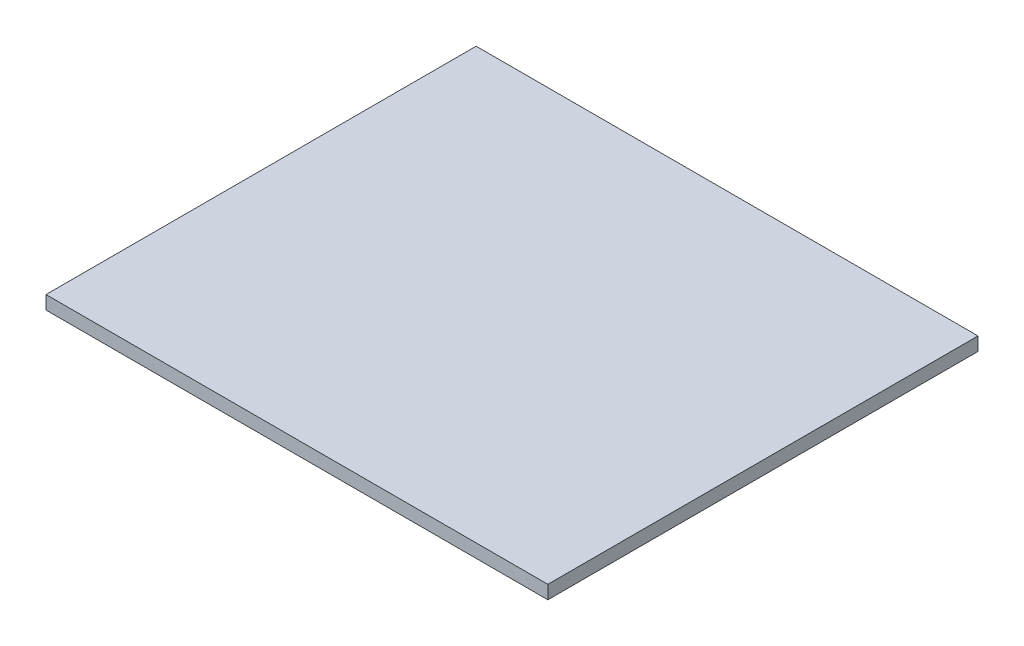
ISO-10303-21;
HEADER;
FILE_DESCRIPTION(('STEP AP214'),'2;1');
FILE_NAME('part.step','',(''),(''),'','','');
FILE_SCHEMA(('AUTOMOTIVE_DESIGN { 1 0 10303 214 1 1 1 1 }'));
ENDSEC;
DATA;
#1=APPLICATION_CONTEXT('core data for automotive mechanical design processes');
#2=APPLICATION_PROTOCOL_DEFINITION('international standard','automotive_design',2000,#1);
#3=PRODUCT_CONTEXT('',#1,'mechanical');
#4=PRODUCT('Part','Part','',(#3));
#5=PRODUCT_RELATED_PRODUCT_CATEGORY('part','',(#4));
#6=PRODUCT_DEFINITION_FORMATION('','',#4);
#7=PRODUCT_DEFINITION_CONTEXT('part definition',#1,'design');
#8=PRODUCT_DEFINITION('design','',#6,#7);
#9=PRODUCT_DEFINITION_SHAPE('','',#8);
#10=(LENGTH_UNIT() NAMED_UNIT(*) SI_UNIT(.MILLI.,.METRE.));
#11=(NAMED_UNIT(*) PLANE_ANGLE_UNIT() SI_UNIT($,.RADIAN.));
#12=(NAMED_UNIT(*) SI_UNIT($,.STERADIAN.) SOLID_ANGLE_UNIT());
#13=UNCERTAINTY_MEASURE_WITH_UNIT(LENGTH_MEASURE(1.E-05),#10,'distance_accuracy_value','');
#14=(GEOMETRIC_REPRESENTATION_CONTEXT(3) GLOBAL_UNCERTAINTY_ASSIGNED_CONTEXT((#13)) GLOBAL_UNIT_ASSIGNED_CONTEXT((#10,
#11,#12)) REPRESENTATION_CONTEXT('',''));
#15=CARTESIAN_POINT('',(0.,0.,0.));
#16=DIRECTION('',(0.,0.,1.));
#17=DIRECTION('',(1.,0.,0.));
#18=AXIS2_PLACEMENT_3D('',#15,#16,#17);
#19=CARTESIAN_POINT('',(355.6,19.05,304.8));
#20=DIRECTION('',(-1.,0.,0.));
#21=DIRECTION('',(0.,0.,1.));
#22=AXIS2_PLACEMENT_3D('',#19,#20,#21);
#23=PLANE('',#22);
#24=DIRECTION('',(0.,0.,-1.));
#25=VECTOR('',#24,1.);
#26=CARTESIAN_POINT('',(355.6,0.,304.8));
#27=LINE('',#26,#25);
#28=CARTESIAN_POINT('',(355.6,0.,304.8));
#29=VERTEX_POINT('',#28);
#30=CARTESIAN_POINT('',(355.6,0.,-304.8));
#31=VERTEX_POINT('',#30);
#32=EDGE_CURVE('E97',#29,#31,#27,.T.);
#33=ORIENTED_EDGE('',*,*,#32,.T.);
#34=DIRECTION('',(0.,-1.,0.));
#35=VECTOR('',#34,1.);
#36=CARTESIAN_POINT('',(355.6,19.05,-304.8));
#37=LINE('',#36,#35);
#38=CARTESIAN_POINT('',(355.6,19.05,-304.8));
#39=VERTEX_POINT('',#38);
#40=EDGE_CURVE('E11',#39,#31,#37,.T.);
#41=ORIENTED_EDGE('',*,*,#40,.F.);
#42=DIRECTION('',(0.,0.,-1.));
#43=VECTOR('',#42,1.);
#44=CARTESIAN_POINT('',(355.6,19.05,304.8));
#45=LINE('',#44,#43);
#46=CARTESIAN_POINT('',(355.6,19.05,304.8));
#47=VERTEX_POINT('',#46);
#48=EDGE_CURVE('E85',#47,#39,#45,.T.);
#49=ORIENTED_EDGE('',*,*,#48,.F.);
#50=DIRECTION('',(0.,-1.,0.));
#51=VECTOR('',#50,1.);
#52=CARTESIAN_POINT('',(355.6,19.05,304.8));
#53=LINE('',#52,#51);
#54=EDGE_CURVE('E93',#47,#29,#53,.T.);
#55=ORIENTED_EDGE('',*,*,#54,.T.);
#56=EDGE_LOOP('',(#33,#41,#49,#55));
#57=FACE_BOUND('',#56,.T.);
#58=ADVANCED_FACE('F34',(#57),#23,.F.);
#59=CARTESIAN_POINT('',(-355.6,19.05,-304.8));
#60=DIRECTION('',(0.,0.,1.));
#61=DIRECTION('',(1.,0.,0.));
#62=AXIS2_PLACEMENT_3D('',#59,#60,#61);
#63=PLANE('',#62);
#64=DIRECTION('',(-1.,0.,0.));
#65=VECTOR('',#64,1.);
#66=CARTESIAN_POINT('',(-355.6,0.,-304.8));
#67=LINE('',#66,#65);
#68=CARTESIAN_POINT('',(-355.6,0.,-304.8));
#69=VERTEX_POINT('',#68);
#70=EDGE_CURVE('E89',#31,#69,#67,.T.);
#71=ORIENTED_EDGE('',*,*,#70,.T.);
#72=DIRECTION('',(0.,-1.,0.));
#73=VECTOR('',#72,1.);
#74=CARTESIAN_POINT('',(-355.6,19.05,-304.8));
#75=LINE('',#74,#73);
#76=CARTESIAN_POINT('',(-355.6,19.05,-304.8));
#77=VERTEX_POINT('',#76);
#78=EDGE_CURVE('E42',#77,#69,#75,.T.);
#79=ORIENTED_EDGE('',*,*,#78,.F.);
#80=DIRECTION('',(-1.,0.,0.));
#81=VECTOR('',#80,1.);
#82=CARTESIAN_POINT('',(-355.6,19.05,-304.8));
#83=LINE('',#82,#81);
#84=EDGE_CURVE('E80',#39,#77,#83,.T.);
#85=ORIENTED_EDGE('',*,*,#84,.F.);
#86=ORIENTED_EDGE('',*,*,#40,.T.);
#87=EDGE_LOOP('',(#71,#79,#85,#86));
#88=FACE_BOUND('',#87,.T.);
#89=ADVANCED_FACE('F88',(#88),#63,.F.);
#90=CARTESIAN_POINT('',(-355.6,19.05,304.8));
#91=DIRECTION('',(1.,0.,0.));
#92=DIRECTION('',(0.,0.,-1.));
#93=AXIS2_PLACEMENT_3D('',#90,#91,#92);
#94=PLANE('',#93);
#95=DIRECTION('',(0.,0.,1.));
#96=VECTOR('',#95,1.);
#97=CARTESIAN_POINT('',(-355.6,0.,304.8));
#98=LINE('',#97,#96);
#99=CARTESIAN_POINT('',(-355.6,0.,304.8));
#100=VERTEX_POINT('',#99);
#101=EDGE_CURVE('E67',#69,#100,#98,.T.);
#102=ORIENTED_EDGE('',*,*,#101,.T.);
#103=DIRECTION('',(0.,-1.,0.));
#104=VECTOR('',#103,1.);
#105=CARTESIAN_POINT('',(-355.6,19.05,304.8));
#106=LINE('',#105,#104);
#107=CARTESIAN_POINT('',(-355.6,19.05,304.8));
#108=VERTEX_POINT('',#107);
#109=EDGE_CURVE('E90',#108,#100,#106,.T.);
#110=ORIENTED_EDGE('',*,*,#109,.F.);
#111=DIRECTION('',(0.,0.,1.));
#112=VECTOR('',#111,1.);
#113=CARTESIAN_POINT('',(-355.6,19.05,304.8));
#114=LINE('',#113,#112);
#115=EDGE_CURVE('E83',#77,#108,#114,.T.);
#116=ORIENTED_EDGE('',*,*,#115,.F.);
#117=ORIENTED_EDGE('',*,*,#78,.T.);
#118=EDGE_LOOP('',(#102,#110,#116,#117));
#119=FACE_BOUND('',#118,.T.);
#120=ADVANCED_FACE('F91',(#119),#94,.F.);
#121=CARTESIAN_POINT('',(-355.6,19.05,304.8));
#122=DIRECTION('',(0.,0.,-1.));
#123=DIRECTION('',(-1.,0.,0.));
#124=AXIS2_PLACEMENT_3D('',#121,#122,#123);
#125=PLANE('',#124);
#126=DIRECTION('',(1.,0.,0.));
#127=VECTOR('',#126,1.);
#128=CARTESIAN_POINT('',(-355.6,0.,304.8));
#129=LINE('',#128,#127);
#130=EDGE_CURVE('E73',#100,#29,#129,.T.);
#131=ORIENTED_EDGE('',*,*,#130,.T.);
#132=ORIENTED_EDGE('',*,*,#54,.F.);
#133=DIRECTION('',(1.,0.,0.));
#134=VECTOR('',#133,1.);
#135=CARTESIAN_POINT('',(-355.6,19.05,304.8));
#136=LINE('',#135,#134);
#137=EDGE_CURVE('E50',#108,#47,#136,.T.);
#138=ORIENTED_EDGE('',*,*,#137,.F.);
#139=ORIENTED_EDGE('',*,*,#109,.T.);
#140=EDGE_LOOP('',(#131,#132,#138,#139));
#141=FACE_BOUND('',#140,.T.);
#142=ADVANCED_FACE('F104',(#141),#125,.F.);
#143=CARTESIAN_POINT('',(0.,19.05,0.));
#144=DIRECTION('',(0.,-1.,0.));
#145=DIRECTION('',(0.,0.,-1.));
#146=AXIS2_PLACEMENT_3D('',#143,#144,#145);
#147=PLANE('',#146);
#148=ORIENTED_EDGE('',*,*,#48,.T.);
#149=ORIENTED_EDGE('',*,*,#84,.T.);
#150=ORIENTED_EDGE('',*,*,#115,.T.);
#151=ORIENTED_EDGE('',*,*,#137,.T.);
#152=EDGE_LOOP('',(#148,#149,#150,#151));
#153=FACE_BOUND('',#152,.T.);
#154=ADVANCED_FACE('F81',(#153),#147,.F.);
#155=CARTESIAN_POINT('',(0.,0.,0.));
#156=DIRECTION('',(0.,-1.,0.));
#157=DIRECTION('',(0.,0.,-1.));
#158=AXIS2_PLACEMENT_3D('',#155,#156,#157);
#159=PLANE('',#158);
#160=ORIENTED_EDGE('',*,*,#32,.F.);
#161=ORIENTED_EDGE('',*,*,#130,.F.);
#162=ORIENTED_EDGE('',*,*,#101,.F.);
#163=ORIENTED_EDGE('',*,*,#70,.F.);
#164=EDGE_LOOP('',(#160,#161,#162,#163));
#165=FACE_BOUND('',#164,.T.);
#166=ADVANCED_FACE('F107',(#165),#159,.T.);
#167=CLOSED_SHELL('',(#58,#89,#120,#142,#154,#166));
#168=MANIFOLD_SOLID_BREP('B2',#167);
#169=ADVANCED_BREP_SHAPE_REPRESENTATION('',(#18,#168),#14);
#170=SHAPE_DEFINITION_REPRESENTATION(#9,#169);
ENDSEC;
END-ISO-10303-21;
